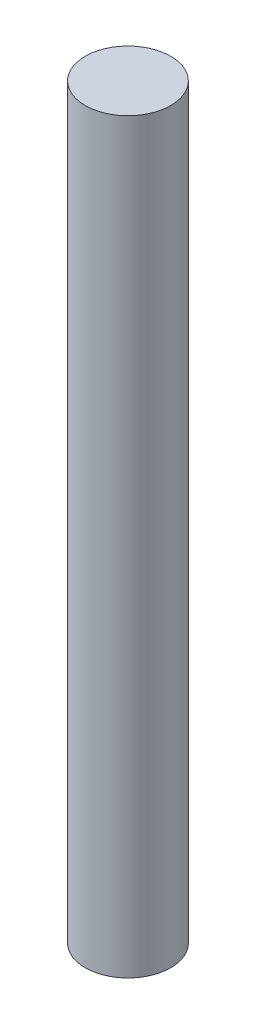
ISO-10303-21;
HEADER;
FILE_DESCRIPTION(('STEP AP214'),'2;1');
FILE_NAME('part.step','',(''),(''),'','','');
FILE_SCHEMA(('AUTOMOTIVE_DESIGN { 1 0 10303 214 1 1 1 1 }'));
ENDSEC;
DATA;
#1=APPLICATION_CONTEXT('core data for automotive mechanical design processes');
#2=APPLICATION_PROTOCOL_DEFINITION('international standard','automotive_design',2000,#1);
#3=PRODUCT_CONTEXT('',#1,'mechanical');
#4=PRODUCT('Part','Part','',(#3));
#5=PRODUCT_RELATED_PRODUCT_CATEGORY('part','',(#4));
#6=PRODUCT_DEFINITION_FORMATION('','',#4);
#7=PRODUCT_DEFINITION_CONTEXT('part definition',#1,'design');
#8=PRODUCT_DEFINITION('design','',#6,#7);
#9=PRODUCT_DEFINITION_SHAPE('','',#8);
#10=(LENGTH_UNIT() NAMED_UNIT(*) SI_UNIT(.MILLI.,.METRE.));
#11=(NAMED_UNIT(*) PLANE_ANGLE_UNIT() SI_UNIT($,.RADIAN.));
#12=(NAMED_UNIT(*) SI_UNIT($,.STERADIAN.) SOLID_ANGLE_UNIT());
#13=UNCERTAINTY_MEASURE_WITH_UNIT(LENGTH_MEASURE(1.E-05),#10,'distance_accuracy_value','');
#14=(GEOMETRIC_REPRESENTATION_CONTEXT(3) GLOBAL_UNCERTAINTY_ASSIGNED_CONTEXT((#13)) GLOBAL_UNIT_ASSIGNED_CONTEXT((#10,
#11,#12)) REPRESENTATION_CONTEXT('',''));
#15=CARTESIAN_POINT('',(0.,0.,0.));
#16=DIRECTION('',(0.,0.,1.));
#17=DIRECTION('',(1.,0.,0.));
#18=AXIS2_PLACEMENT_3D('',#15,#16,#17);
#19=CARTESIAN_POINT('',(0.,43.7,0.));
#20=DIRECTION('',(0.,-1.,0.));
#21=DIRECTION('',(0.,0.,-1.));
#22=AXIS2_PLACEMENT_3D('',#19,#20,#21);
#23=CYLINDRICAL_SURFACE('',#22,2.5);
#24=CARTESIAN_POINT('',(0.,43.7,0.));
#25=DIRECTION('',(0.,1.,0.));
#26=DIRECTION('',(0.,0.,1.));
#27=AXIS2_PLACEMENT_3D('',#24,#25,#26);
#28=CIRCLE('',#27,2.5);
#29=CARTESIAN_POINT('',(0.,43.7,2.5));
#30=VERTEX_POINT('',#29);
#31=EDGE_CURVE('E10',#30,#30,#28,.T.);
#32=ORIENTED_EDGE('',*,*,#31,.F.);
#33=EDGE_LOOP('',(#32));
#34=FACE_BOUND('',#33,.T.);
#35=CARTESIAN_POINT('',(0.,0.,0.));
#36=DIRECTION('',(0.,1.,0.));
#37=DIRECTION('',(0.,0.,1.));
#38=AXIS2_PLACEMENT_3D('',#35,#36,#37);
#39=CIRCLE('',#38,2.5);
#40=CARTESIAN_POINT('',(0.,0.,2.5));
#41=VERTEX_POINT('',#40);
#42=EDGE_CURVE('E36',#41,#41,#39,.T.);
#43=ORIENTED_EDGE('',*,*,#42,.T.);
#44=EDGE_LOOP('',(#43));
#45=FACE_BOUND('',#44,.T.);
#46=ADVANCED_FACE('F33',(#34,#45),#23,.T.);
#47=CARTESIAN_POINT('',(0.,43.7,0.));
#48=DIRECTION('',(0.,1.,0.));
#49=DIRECTION('',(0.,0.,1.));
#50=AXIS2_PLACEMENT_3D('',#47,#48,#49);
#51=PLANE('',#50);
#52=ORIENTED_EDGE('',*,*,#31,.T.);
#53=EDGE_LOOP('',(#52));
#54=FACE_BOUND('',#53,.T.);
#55=ADVANCED_FACE('F48',(#54),#51,.T.);
#56=CARTESIAN_POINT('',(0.,0.,0.));
#57=DIRECTION('',(0.,1.,0.));
#58=DIRECTION('',(0.,0.,1.));
#59=AXIS2_PLACEMENT_3D('',#56,#57,#58);
#60=PLANE('',#59);
#61=ORIENTED_EDGE('',*,*,#42,.F.);
#62=EDGE_LOOP('',(#61));
#63=FACE_BOUND('',#62,.T.);
#64=ADVANCED_FACE('F46',(#63),#60,.F.);
#65=CLOSED_SHELL('',(#46,#55,#64));
#66=MANIFOLD_SOLID_BREP('B2',#65);
#67=ADVANCED_BREP_SHAPE_REPRESENTATION('',(#18,#66),#14);
#68=SHAPE_DEFINITION_REPRESENTATION(#9,#67);
ENDSEC;
END-ISO-10303-21;
